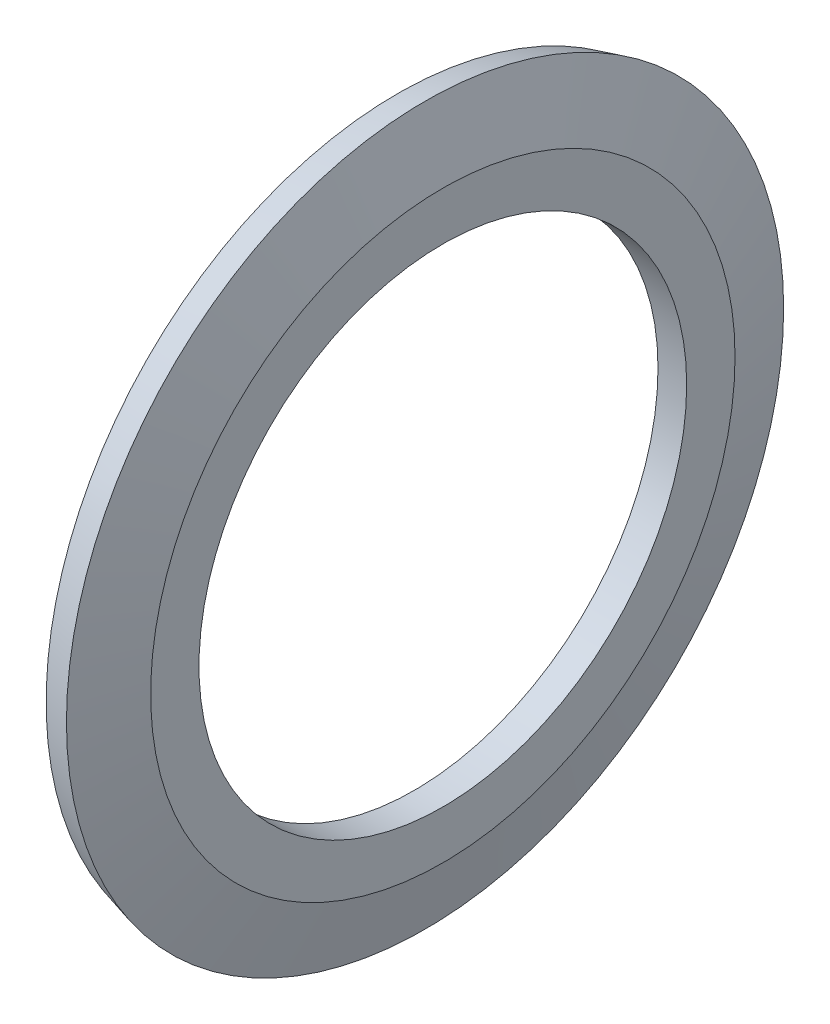
ISO-10303-21;
HEADER;
FILE_DESCRIPTION(('STEP AP214'),'2;1');
FILE_NAME('part.step','',(''),(''),'','','');
FILE_SCHEMA(('AUTOMOTIVE_DESIGN { 1 0 10303 214 1 1 1 1 }'));
ENDSEC;
DATA;
#1=APPLICATION_CONTEXT('core data for automotive mechanical design processes');
#2=APPLICATION_PROTOCOL_DEFINITION('international standard','automotive_design',2000,#1);
#3=PRODUCT_CONTEXT('',#1,'mechanical');
#4=PRODUCT('Part','Part','',(#3));
#5=PRODUCT_RELATED_PRODUCT_CATEGORY('part','',(#4));
#6=PRODUCT_DEFINITION_FORMATION('','',#4);
#7=PRODUCT_DEFINITION_CONTEXT('part definition',#1,'design');
#8=PRODUCT_DEFINITION('design','',#6,#7);
#9=PRODUCT_DEFINITION_SHAPE('','',#8);
#10=(LENGTH_UNIT() NAMED_UNIT(*) SI_UNIT(.MILLI.,.METRE.));
#11=(NAMED_UNIT(*) PLANE_ANGLE_UNIT() SI_UNIT($,.RADIAN.));
#12=(NAMED_UNIT(*) SI_UNIT($,.STERADIAN.) SOLID_ANGLE_UNIT());
#13=UNCERTAINTY_MEASURE_WITH_UNIT(LENGTH_MEASURE(1.E-05),#10,'distance_accuracy_value','');
#14=(GEOMETRIC_REPRESENTATION_CONTEXT(3) GLOBAL_UNCERTAINTY_ASSIGNED_CONTEXT((#13)) GLOBAL_UNIT_ASSIGNED_CONTEXT((#10,
#11,#12)) REPRESENTATION_CONTEXT('',''));
#15=CARTESIAN_POINT('',(0.,0.,0.));
#16=DIRECTION('',(0.,0.,1.));
#17=DIRECTION('',(1.,0.,0.));
#18=AXIS2_PLACEMENT_3D('',#15,#16,#17);
#19=CARTESIAN_POINT('',(0.,8.5,0.));
#20=DIRECTION('',(-1.,0.,0.));
#21=DIRECTION('',(0.,0.,1.));
#22=AXIS2_PLACEMENT_3D('',#19,#20,#21);
#23=PLANE('',#22);
#24=CARTESIAN_POINT('',(0.,0.,0.));
#25=DIRECTION('',(1.,0.,0.));
#26=DIRECTION('',(0.,0.,-1.));
#27=AXIS2_PLACEMENT_3D('',#24,#25,#26);
#28=CIRCLE('',#27,8.5);
#29=CARTESIAN_POINT('',(0.,0.,-8.5));
#30=VERTEX_POINT('',#29);
#31=EDGE_CURVE('E62',#30,#30,#28,.T.);
#32=ORIENTED_EDGE('',*,*,#31,.T.);
#33=EDGE_LOOP('',(#32));
#34=FACE_BOUND('',#33,.T.);
#35=CARTESIAN_POINT('',(0.,0.,0.));
#36=DIRECTION('',(1.,0.,0.));
#37=DIRECTION('',(0.,0.,-1.));
#38=AXIS2_PLACEMENT_3D('',#35,#36,#37);
#39=CIRCLE('',#38,10.0533475024126);
#40=CARTESIAN_POINT('',(0.,0.,-10.0533475024126));
#41=VERTEX_POINT('',#40);
#42=EDGE_CURVE('E10',#41,#41,#39,.T.);
#43=ORIENTED_EDGE('',*,*,#42,.F.);
#44=EDGE_LOOP('',(#43));
#45=FACE_BOUND('',#44,.T.);
#46=ADVANCED_FACE('F35',(#34,#45),#23,.T.);
#47=CARTESIAN_POINT('',(-0.586228206767104,0.,0.));
#48=DIRECTION('',(-1.,0.,0.));
#49=DIRECTION('',(0.,0.,1.));
#50=AXIS2_PLACEMENT_3D('',#47,#48,#49);
#51=CONICAL_SURFACE('',#50,12.2411809548975,1.30899693899575);
#52=ORIENTED_EDGE('',*,*,#42,.T.);
#53=EDGE_LOOP('',(#52));
#54=FACE_BOUND('',#53,.T.);
#55=CARTESIAN_POINT('',(-0.586228206767104,0.,0.));
#56=DIRECTION('',(1.,0.,0.));
#57=DIRECTION('',(0.,0.,-1.));
#58=AXIS2_PLACEMENT_3D('',#55,#56,#57);
#59=CIRCLE('',#58,12.2411809548975);
#60=CARTESIAN_POINT('',(-0.586228206767104,0.,-12.2411809548975));
#61=VERTEX_POINT('',#60);
#62=EDGE_CURVE('E42',#61,#61,#59,.T.);
#63=ORIENTED_EDGE('',*,*,#62,.F.);
#64=EDGE_LOOP('',(#63));
#65=FACE_BOUND('',#64,.T.);
#66=ADVANCED_FACE('F81',(#54,#65),#51,.F.);
#67=CARTESIAN_POINT('',(0.379697619521966,0.,0.));
#68=DIRECTION('',(1.,0.,0.));
#69=DIRECTION('',(0.,0.,-1.));
#70=AXIS2_PLACEMENT_3D('',#67,#68,#69);
#71=CONICAL_SURFACE('',#70,12.5,0.261799387799143);
#72=ORIENTED_EDGE('',*,*,#62,.T.);
#73=EDGE_LOOP('',(#72));
#74=FACE_BOUND('',#73,.T.);
#75=CARTESIAN_POINT('',(0.379697619521966,0.,0.));
#76=DIRECTION('',(1.,0.,0.));
#77=DIRECTION('',(0.,0.,-1.));
#78=AXIS2_PLACEMENT_3D('',#75,#76,#77);
#79=CIRCLE('',#78,12.5);
#80=CARTESIAN_POINT('',(0.379697619521966,0.,-12.5));
#81=VERTEX_POINT('',#80);
#82=EDGE_CURVE('E49',#81,#81,#79,.T.);
#83=ORIENTED_EDGE('',*,*,#82,.F.);
#84=EDGE_LOOP('',(#83));
#85=FACE_BOUND('',#84,.T.);
#86=ADVANCED_FACE('F85',(#74,#85),#71,.T.);
#87=CARTESIAN_POINT('',(1.,0.,0.));
#88=DIRECTION('',(-1.,0.,0.));
#89=DIRECTION('',(0.,0.,1.));
#90=AXIS2_PLACEMENT_3D('',#87,#88,#89);
#91=CONICAL_SURFACE('',#90,10.185,1.30899693899575);
#92=ORIENTED_EDGE('',*,*,#82,.T.);
#93=EDGE_LOOP('',(#92));
#94=FACE_BOUND('',#93,.T.);
#95=CARTESIAN_POINT('',(1.,0.,0.));
#96=DIRECTION('',(1.,0.,0.));
#97=DIRECTION('',(0.,0.,-1.));
#98=AXIS2_PLACEMENT_3D('',#95,#96,#97);
#99=CIRCLE('',#98,10.185);
#100=CARTESIAN_POINT('',(1.,0.,-10.185));
#101=VERTEX_POINT('',#100);
#102=EDGE_CURVE('E53',#101,#101,#99,.T.);
#103=ORIENTED_EDGE('',*,*,#102,.F.);
#104=EDGE_LOOP('',(#103));
#105=FACE_BOUND('',#104,.T.);
#106=ADVANCED_FACE('F77',(#94,#105),#91,.T.);
#107=CARTESIAN_POINT('',(0.999999999999999,8.5,0.));
#108=DIRECTION('',(1.,0.,0.));
#109=DIRECTION('',(0.,0.,-1.));
#110=AXIS2_PLACEMENT_3D('',#107,#108,#109);
#111=PLANE('',#110);
#112=ORIENTED_EDGE('',*,*,#102,.T.);
#113=EDGE_LOOP('',(#112));
#114=FACE_BOUND('',#113,.T.);
#115=CARTESIAN_POINT('',(0.999999999999999,0.,0.));
#116=DIRECTION('',(1.,0.,0.));
#117=DIRECTION('',(0.,0.,-1.));
#118=AXIS2_PLACEMENT_3D('',#115,#116,#117);
#119=CIRCLE('',#118,8.5);
#120=CARTESIAN_POINT('',(0.999999999999999,0.,-8.5));
#121=VERTEX_POINT('',#120);
#122=EDGE_CURVE('E58',#121,#121,#119,.T.);
#123=ORIENTED_EDGE('',*,*,#122,.F.);
#124=EDGE_LOOP('',(#123));
#125=FACE_BOUND('',#124,.T.);
#126=ADVANCED_FACE('F71',(#114,#125),#111,.T.);
#127=CARTESIAN_POINT('',(1.,0.,0.));
#128=DIRECTION('',(1.,0.,0.));
#129=DIRECTION('',(0.,0.,-1.));
#130=AXIS2_PLACEMENT_3D('',#127,#128,#129);
#131=CYLINDRICAL_SURFACE('',#130,8.5);
#132=ORIENTED_EDGE('',*,*,#122,.T.);
#133=EDGE_LOOP('',(#132));
#134=FACE_BOUND('',#133,.T.);
#135=ORIENTED_EDGE('',*,*,#31,.F.);
#136=EDGE_LOOP('',(#135));
#137=FACE_BOUND('',#136,.T.);
#138=ADVANCED_FACE('F69',(#134,#137),#131,.F.);
#139=CLOSED_SHELL('',(#46,#66,#86,#106,#126,#138));
#140=MANIFOLD_SOLID_BREP('B2',#139);
#141=ADVANCED_BREP_SHAPE_REPRESENTATION('',(#18,#140),#14);
#142=SHAPE_DEFINITION_REPRESENTATION(#9,#141);
ENDSEC;
END-ISO-10303-21;
